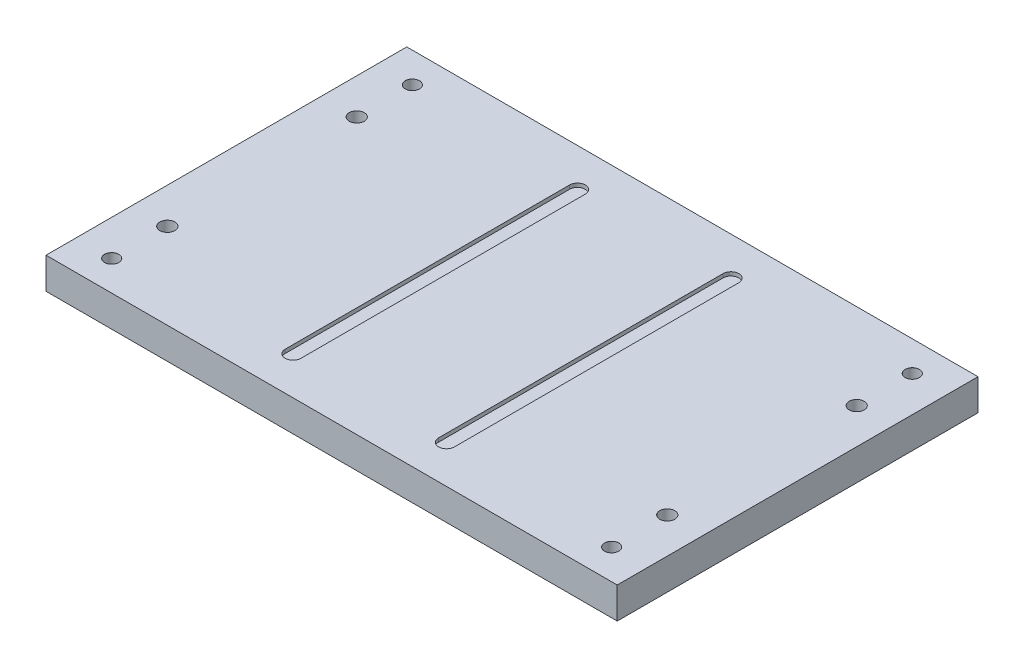
ISO-10303-21;
HEADER;
FILE_DESCRIPTION(('STEP AP214'),'2;1');
FILE_NAME('part.step','',(''),(''),'','','');
FILE_SCHEMA(('AUTOMOTIVE_DESIGN { 1 0 10303 214 1 1 1 1 }'));
ENDSEC;
DATA;
#1=APPLICATION_CONTEXT('core data for automotive mechanical design processes');
#2=APPLICATION_PROTOCOL_DEFINITION('international standard','automotive_design',2000,#1);
#3=PRODUCT_CONTEXT('',#1,'mechanical');
#4=PRODUCT('Part','Part','',(#3));
#5=PRODUCT_RELATED_PRODUCT_CATEGORY('part','',(#4));
#6=PRODUCT_DEFINITION_FORMATION('','',#4);
#7=PRODUCT_DEFINITION_CONTEXT('part definition',#1,'design');
#8=PRODUCT_DEFINITION('design','',#6,#7);
#9=PRODUCT_DEFINITION_SHAPE('','',#8);
#10=(LENGTH_UNIT() NAMED_UNIT(*) SI_UNIT(.MILLI.,.METRE.));
#11=(NAMED_UNIT(*) PLANE_ANGLE_UNIT() SI_UNIT($,.RADIAN.));
#12=(NAMED_UNIT(*) SI_UNIT($,.STERADIAN.) SOLID_ANGLE_UNIT());
#13=UNCERTAINTY_MEASURE_WITH_UNIT(LENGTH_MEASURE(1.E-05),#10,'distance_accuracy_value','');
#14=(GEOMETRIC_REPRESENTATION_CONTEXT(3) GLOBAL_UNCERTAINTY_ASSIGNED_CONTEXT((#13)) GLOBAL_UNIT_ASSIGNED_CONTEXT((#10,
#11,#12)) REPRESENTATION_CONTEXT('',''));
#15=CARTESIAN_POINT('',(0.,0.,0.));
#16=DIRECTION('',(0.,0.,1.));
#17=DIRECTION('',(1.,0.,0.));
#18=AXIS2_PLACEMENT_3D('',#15,#16,#17);
#19=CARTESIAN_POINT('',(0.,26.416,0.));
#20=DIRECTION('',(0.,-1.,0.));
#21=DIRECTION('',(0.,0.,-1.));
#22=AXIS2_PLACEMENT_3D('',#19,#20,#21);
#23=PLANE('',#22);
#24=CARTESIAN_POINT('',(-211.201,26.416,-127.));
#25=DIRECTION('',(0.,1.,0.));
#26=DIRECTION('',(0.,0.,1.));
#27=AXIS2_PLACEMENT_3D('',#24,#25,#26);
#28=CIRCLE('',#27,6.025);
#29=CARTESIAN_POINT('',(-211.201,26.416,-120.975));
#30=VERTEX_POINT('',#29);
#31=EDGE_CURVE('E647',#30,#30,#28,.T.);
#32=ORIENTED_EDGE('',*,*,#31,.F.);
#33=EDGE_LOOP('',(#32));
#34=FACE_BOUND('',#33,.T.);
#35=CARTESIAN_POINT('',(211.201,26.416,-127.));
#36=DIRECTION('',(0.,1.,0.));
#37=DIRECTION('',(0.,0.,1.));
#38=AXIS2_PLACEMENT_3D('',#35,#36,#37);
#39=CIRCLE('',#38,6.025);
#40=CARTESIAN_POINT('',(211.201,26.416,-120.975));
#41=VERTEX_POINT('',#40);
#42=EDGE_CURVE('E658',#41,#41,#39,.T.);
#43=ORIENTED_EDGE('',*,*,#42,.F.);
#44=EDGE_LOOP('',(#43));
#45=FACE_BOUND('',#44,.T.);
#46=CARTESIAN_POINT('',(211.201,26.416,127.));
#47=DIRECTION('',(0.,1.,0.));
#48=DIRECTION('',(0.,0.,1.));
#49=AXIS2_PLACEMENT_3D('',#46,#47,#48);
#50=CIRCLE('',#49,6.025);
#51=CARTESIAN_POINT('',(211.201,26.416,133.025));
#52=VERTEX_POINT('',#51);
#53=EDGE_CURVE('E670',#52,#52,#50,.T.);
#54=ORIENTED_EDGE('',*,*,#53,.F.);
#55=EDGE_LOOP('',(#54));
#56=FACE_BOUND('',#55,.T.);
#57=CARTESIAN_POINT('',(-211.201,26.416,127.));
#58=DIRECTION('',(0.,1.,0.));
#59=DIRECTION('',(0.,0.,1.));
#60=AXIS2_PLACEMENT_3D('',#57,#58,#59);
#61=CIRCLE('',#60,6.025);
#62=CARTESIAN_POINT('',(-211.201,26.416,133.025));
#63=VERTEX_POINT('',#62);
#64=EDGE_CURVE('E682',#63,#63,#61,.T.);
#65=ORIENTED_EDGE('',*,*,#64,.F.);
#66=EDGE_LOOP('',(#65));
#67=FACE_BOUND('',#66,.T.);
#68=CARTESIAN_POINT('',(-211.201,26.416,-80.01));
#69=DIRECTION('',(0.,1.,0.));
#70=DIRECTION('',(0.,0.,-1.));
#71=AXIS2_PLACEMENT_3D('',#68,#69,#70);
#72=CIRCLE('',#71,6.34999999999999);
#73=CARTESIAN_POINT('',(-211.201,26.416,-86.36));
#74=VERTEX_POINT('',#73);
#75=EDGE_CURVE('E711',#74,#74,#72,.T.);
#76=ORIENTED_EDGE('',*,*,#75,.F.);
#77=EDGE_LOOP('',(#76));
#78=FACE_BOUND('',#77,.T.);
#79=CARTESIAN_POINT('',(211.201,26.416,80.0099999999999));
#80=DIRECTION('',(0.,1.,0.));
#81=DIRECTION('',(0.,0.,-1.));
#82=AXIS2_PLACEMENT_3D('',#79,#80,#81);
#83=CIRCLE('',#82,6.34999999999999);
#84=CARTESIAN_POINT('',(211.201,26.416,73.66));
#85=VERTEX_POINT('',#84);
#86=EDGE_CURVE('E695',#85,#85,#83,.T.);
#87=ORIENTED_EDGE('',*,*,#86,.F.);
#88=EDGE_LOOP('',(#87));
#89=FACE_BOUND('',#88,.T.);
#90=CARTESIAN_POINT('',(211.201,26.416,-80.01));
#91=DIRECTION('',(0.,1.,0.));
#92=DIRECTION('',(0.,0.,1.));
#93=AXIS2_PLACEMENT_3D('',#90,#91,#92);
#94=CIRCLE('',#93,6.34999999999999);
#95=CARTESIAN_POINT('',(211.201,26.416,-73.6600000000001));
#96=VERTEX_POINT('',#95);
#97=EDGE_CURVE('E704',#96,#96,#94,.T.);
#98=ORIENTED_EDGE('',*,*,#97,.F.);
#99=EDGE_LOOP('',(#98));
#100=FACE_BOUND('',#99,.T.);
#101=CARTESIAN_POINT('',(-211.201,26.416,80.01));
#102=DIRECTION('',(0.,1.,0.));
#103=DIRECTION('',(0.,0.,1.));
#104=AXIS2_PLACEMENT_3D('',#101,#102,#103);
#105=CIRCLE('',#104,6.34999999999999);
#106=CARTESIAN_POINT('',(-211.201,26.416,86.36));
#107=VERTEX_POINT('',#106);
#108=EDGE_CURVE('E166',#107,#107,#105,.T.);
#109=ORIENTED_EDGE('',*,*,#108,.F.);
#110=EDGE_LOOP('',(#109));
#111=FACE_BOUND('',#110,.T.);
#112=DIRECTION('',(0.,0.,-1.));
#113=VECTOR('',#112,1.);
#114=CARTESIAN_POINT('',(-71.501,26.416,0.));
#115=LINE('',#114,#113);
#116=CARTESIAN_POINT('',(-71.501,26.416,120.142));
#117=VERTEX_POINT('',#116);
#118=CARTESIAN_POINT('',(-71.501,26.416,-120.142));
#119=VERTEX_POINT('',#118);
#120=EDGE_CURVE('E175',#117,#119,#115,.T.);
#121=ORIENTED_EDGE('',*,*,#120,.T.);
#122=CARTESIAN_POINT('',(-64.8335,26.416,-120.142));
#123=DIRECTION('',(0.,1.,0.));
#124=DIRECTION('',(0.,0.,1.));
#125=AXIS2_PLACEMENT_3D('',#122,#123,#124);
#126=CIRCLE('',#125,6.6675);
#127=CARTESIAN_POINT('',(-58.166,26.416,-120.142));
#128=VERTEX_POINT('',#127);
#129=EDGE_CURVE('E60',#128,#119,#126,.T.);
#130=ORIENTED_EDGE('',*,*,#129,.F.);
#131=DIRECTION('',(0.,0.,-1.));
#132=VECTOR('',#131,1.);
#133=CARTESIAN_POINT('',(-58.166,26.416,0.));
#134=LINE('',#133,#132);
#135=CARTESIAN_POINT('',(-58.166,26.416,120.142));
#136=VERTEX_POINT('',#135);
#137=EDGE_CURVE('E158',#136,#128,#134,.T.);
#138=ORIENTED_EDGE('',*,*,#137,.F.);
#139=CARTESIAN_POINT('',(-64.8335,26.416,120.142));
#140=DIRECTION('',(0.,1.,0.));
#141=DIRECTION('',(0.,0.,1.));
#142=AXIS2_PLACEMENT_3D('',#139,#140,#141);
#143=CIRCLE('',#142,6.6675);
#144=EDGE_CURVE('E163',#136,#117,#143,.F.);
#145=ORIENTED_EDGE('',*,*,#144,.T.);
#146=EDGE_LOOP('',(#121,#130,#138,#145));
#147=FACE_BOUND('',#146,.T.);
#148=DIRECTION('',(0.,0.,-1.));
#149=VECTOR('',#148,1.);
#150=CARTESIAN_POINT('',(241.3,26.416,152.4));
#151=LINE('',#150,#149);
#152=CARTESIAN_POINT('',(241.3,26.416,152.4));
#153=VERTEX_POINT('',#152);
#154=CARTESIAN_POINT('',(241.3,26.416,-152.4));
#155=VERTEX_POINT('',#154);
#156=EDGE_CURVE('E231',#153,#155,#151,.T.);
#157=ORIENTED_EDGE('',*,*,#156,.T.);
#158=DIRECTION('',(-1.,0.,0.));
#159=VECTOR('',#158,1.);
#160=CARTESIAN_POINT('',(-241.3,26.416,-152.4));
#161=LINE('',#160,#159);
#162=CARTESIAN_POINT('',(-241.3,26.416,-152.4));
#163=VERTEX_POINT('',#162);
#164=EDGE_CURVE('E235',#155,#163,#161,.T.);
#165=ORIENTED_EDGE('',*,*,#164,.T.);
#166=DIRECTION('',(0.,0.,1.));
#167=VECTOR('',#166,1.);
#168=CARTESIAN_POINT('',(-241.3,26.416,152.4));
#169=LINE('',#168,#167);
#170=CARTESIAN_POINT('',(-241.3,26.416,152.4));
#171=VERTEX_POINT('',#170);
#172=EDGE_CURVE('E239',#163,#171,#169,.T.);
#173=ORIENTED_EDGE('',*,*,#172,.T.);
#174=DIRECTION('',(1.,0.,0.));
#175=VECTOR('',#174,1.);
#176=CARTESIAN_POINT('',(-241.3,26.416,152.4));
#177=LINE('',#176,#175);
#178=EDGE_CURVE('E242',#171,#153,#177,.T.);
#179=ORIENTED_EDGE('',*,*,#178,.T.);
#180=EDGE_LOOP('',(#157,#165,#173,#179));
#181=FACE_BOUND('',#180,.T.);
#182=CARTESIAN_POINT('',(64.8335,26.416,-120.142));
#183=DIRECTION('',(0.,1.,0.));
#184=DIRECTION('',(0.,0.,1.));
#185=AXIS2_PLACEMENT_3D('',#182,#183,#184);
#186=CIRCLE('',#185,6.66749999999999);
#187=CARTESIAN_POINT('',(58.1660000000001,26.416,-120.142));
#188=VERTEX_POINT('',#187);
#189=CARTESIAN_POINT('',(71.501,26.416,-120.142));
#190=VERTEX_POINT('',#189);
#191=EDGE_CURVE('E68',#188,#190,#186,.F.);
#192=ORIENTED_EDGE('',*,*,#191,.T.);
#193=DIRECTION('',(0.,0.,-1.));
#194=VECTOR('',#193,1.);
#195=CARTESIAN_POINT('',(71.501,26.416,0.));
#196=LINE('',#195,#194);
#197=CARTESIAN_POINT('',(71.501,26.416,120.142));
#198=VERTEX_POINT('',#197);
#199=EDGE_CURVE('E204',#198,#190,#196,.T.);
#200=ORIENTED_EDGE('',*,*,#199,.F.);
#201=CARTESIAN_POINT('',(64.8335000000001,26.416,120.142));
#202=DIRECTION('',(0.,1.,0.));
#203=DIRECTION('',(0.,0.,1.));
#204=AXIS2_PLACEMENT_3D('',#201,#202,#203);
#205=CIRCLE('',#204,6.66749999999999);
#206=CARTESIAN_POINT('',(58.1660000000001,26.416,120.142));
#207=VERTEX_POINT('',#206);
#208=EDGE_CURVE('E208',#207,#198,#205,.T.);
#209=ORIENTED_EDGE('',*,*,#208,.F.);
#210=DIRECTION('',(0.,0.,-1.));
#211=VECTOR('',#210,1.);
#212=CARTESIAN_POINT('',(58.1660000000001,26.416,0.));
#213=LINE('',#212,#211);
#214=EDGE_CURVE('E213',#207,#188,#213,.T.);
#215=ORIENTED_EDGE('',*,*,#214,.T.);
#216=EDGE_LOOP('',(#192,#200,#209,#215));
#217=FACE_BOUND('',#216,.T.);
#218=ADVANCED_FACE('F44',(#34,#45,#56,#67,#78,#89,#100,#111,#147,#181,#217),#23,.F.);
#219=CARTESIAN_POINT('',(241.3,26.416,152.4));
#220=DIRECTION('',(-1.,0.,0.));
#221=DIRECTION('',(0.,0.,1.));
#222=AXIS2_PLACEMENT_3D('',#219,#220,#221);
#223=PLANE('',#222);
#224=DIRECTION('',(0.,0.,-1.));
#225=VECTOR('',#224,1.);
#226=CARTESIAN_POINT('',(241.3,0.,152.4));
#227=LINE('',#226,#225);
#228=CARTESIAN_POINT('',(241.3,0.,152.4));
#229=VERTEX_POINT('',#228);
#230=CARTESIAN_POINT('',(241.3,0.,-152.4));
#231=VERTEX_POINT('',#230);
#232=EDGE_CURVE('E184',#229,#231,#227,.T.);
#233=ORIENTED_EDGE('',*,*,#232,.T.);
#234=DIRECTION('',(0.,-1.,0.));
#235=VECTOR('',#234,1.);
#236=CARTESIAN_POINT('',(241.3,26.416,-152.4));
#237=LINE('',#236,#235);
#238=EDGE_CURVE('E11',#155,#231,#237,.T.);
#239=ORIENTED_EDGE('',*,*,#238,.F.);
#240=ORIENTED_EDGE('',*,*,#156,.F.);
#241=DIRECTION('',(0.,-1.,0.));
#242=VECTOR('',#241,1.);
#243=CARTESIAN_POINT('',(241.3,26.416,152.4));
#244=LINE('',#243,#242);
#245=EDGE_CURVE('E245',#153,#229,#244,.T.);
#246=ORIENTED_EDGE('',*,*,#245,.T.);
#247=EDGE_LOOP('',(#233,#239,#240,#246));
#248=FACE_BOUND('',#247,.T.);
#249=ADVANCED_FACE('F46',(#248),#223,.F.);
#250=CARTESIAN_POINT('',(-241.3,26.416,-152.4));
#251=DIRECTION('',(0.,0.,1.));
#252=DIRECTION('',(1.,0.,0.));
#253=AXIS2_PLACEMENT_3D('',#250,#251,#252);
#254=PLANE('',#253);
#255=DIRECTION('',(-1.,0.,0.));
#256=VECTOR('',#255,1.);
#257=CARTESIAN_POINT('',(-241.3,0.,-152.4));
#258=LINE('',#257,#256);
#259=CARTESIAN_POINT('',(-241.3,0.,-152.4));
#260=VERTEX_POINT('',#259);
#261=EDGE_CURVE('E249',#231,#260,#258,.T.);
#262=ORIENTED_EDGE('',*,*,#261,.T.);
#263=DIRECTION('',(0.,-1.,0.));
#264=VECTOR('',#263,1.);
#265=CARTESIAN_POINT('',(-241.3,26.416,-152.4));
#266=LINE('',#265,#264);
#267=EDGE_CURVE('E53',#163,#260,#266,.T.);
#268=ORIENTED_EDGE('',*,*,#267,.F.);
#269=ORIENTED_EDGE('',*,*,#164,.F.);
#270=ORIENTED_EDGE('',*,*,#238,.T.);
#271=EDGE_LOOP('',(#262,#268,#269,#270));
#272=FACE_BOUND('',#271,.T.);
#273=ADVANCED_FACE('F286',(#272),#254,.F.);
#274=CARTESIAN_POINT('',(-241.3,26.416,152.4));
#275=DIRECTION('',(1.,0.,0.));
#276=DIRECTION('',(0.,0.,-1.));
#277=AXIS2_PLACEMENT_3D('',#274,#275,#276);
#278=PLANE('',#277);
#279=DIRECTION('',(0.,0.,1.));
#280=VECTOR('',#279,1.);
#281=CARTESIAN_POINT('',(-241.3,0.,152.4));
#282=LINE('',#281,#280);
#283=CARTESIAN_POINT('',(-241.3,0.,152.4));
#284=VERTEX_POINT('',#283);
#285=EDGE_CURVE('E252',#260,#284,#282,.T.);
#286=ORIENTED_EDGE('',*,*,#285,.T.);
#287=DIRECTION('',(0.,-1.,0.));
#288=VECTOR('',#287,1.);
#289=CARTESIAN_POINT('',(-241.3,26.416,152.4));
#290=LINE('',#289,#288);
#291=EDGE_CURVE('E260',#171,#284,#290,.T.);
#292=ORIENTED_EDGE('',*,*,#291,.F.);
#293=ORIENTED_EDGE('',*,*,#172,.F.);
#294=ORIENTED_EDGE('',*,*,#267,.T.);
#295=EDGE_LOOP('',(#286,#292,#293,#294));
#296=FACE_BOUND('',#295,.T.);
#297=ADVANCED_FACE('F270',(#296),#278,.F.);
#298=CARTESIAN_POINT('',(-241.3,26.416,152.4));
#299=DIRECTION('',(0.,0.,-1.));
#300=DIRECTION('',(-1.,0.,0.));
#301=AXIS2_PLACEMENT_3D('',#298,#299,#300);
#302=PLANE('',#301);
#303=DIRECTION('',(1.,0.,0.));
#304=VECTOR('',#303,1.);
#305=CARTESIAN_POINT('',(-241.3,0.,152.4));
#306=LINE('',#305,#304);
#307=EDGE_CURVE('E236',#284,#229,#306,.T.);
#308=ORIENTED_EDGE('',*,*,#307,.T.);
#309=ORIENTED_EDGE('',*,*,#245,.F.);
#310=ORIENTED_EDGE('',*,*,#178,.F.);
#311=ORIENTED_EDGE('',*,*,#291,.T.);
#312=EDGE_LOOP('',(#308,#309,#310,#311));
#313=FACE_BOUND('',#312,.T.);
#314=ADVANCED_FACE('F279',(#313),#302,.F.);
#315=CARTESIAN_POINT('',(0.,0.,0.));
#316=DIRECTION('',(0.,-1.,0.));
#317=DIRECTION('',(0.,0.,-1.));
#318=AXIS2_PLACEMENT_3D('',#315,#316,#317);
#319=PLANE('',#318);
#320=CARTESIAN_POINT('',(-211.201,0.,-127.));
#321=DIRECTION('',(0.,1.,0.));
#322=DIRECTION('',(0.,0.,1.));
#323=AXIS2_PLACEMENT_3D('',#320,#321,#322);
#324=CIRCLE('',#323,6.00000000000001);
#325=CARTESIAN_POINT('',(-211.201,0.,-121.));
#326=VERTEX_POINT('',#325);
#327=EDGE_CURVE('E652',#326,#326,#324,.T.);
#328=ORIENTED_EDGE('',*,*,#327,.T.);
#329=EDGE_LOOP('',(#328));
#330=FACE_BOUND('',#329,.T.);
#331=CARTESIAN_POINT('',(211.201,0.,-127.));
#332=DIRECTION('',(0.,1.,0.));
#333=DIRECTION('',(0.,0.,1.));
#334=AXIS2_PLACEMENT_3D('',#331,#332,#333);
#335=CIRCLE('',#334,6.00000000000001);
#336=CARTESIAN_POINT('',(211.201,0.,-121.));
#337=VERTEX_POINT('',#336);
#338=EDGE_CURVE('E666',#337,#337,#335,.T.);
#339=ORIENTED_EDGE('',*,*,#338,.T.);
#340=EDGE_LOOP('',(#339));
#341=FACE_BOUND('',#340,.T.);
#342=CARTESIAN_POINT('',(211.201,0.,127.));
#343=DIRECTION('',(0.,1.,0.));
#344=DIRECTION('',(0.,0.,1.));
#345=AXIS2_PLACEMENT_3D('',#342,#343,#344);
#346=CIRCLE('',#345,6.00000000000001);
#347=CARTESIAN_POINT('',(211.201,0.,133.));
#348=VERTEX_POINT('',#347);
#349=EDGE_CURVE('E678',#348,#348,#346,.T.);
#350=ORIENTED_EDGE('',*,*,#349,.T.);
#351=EDGE_LOOP('',(#350));
#352=FACE_BOUND('',#351,.T.);
#353=CARTESIAN_POINT('',(-211.201,0.,127.));
#354=DIRECTION('',(0.,1.,0.));
#355=DIRECTION('',(0.,0.,1.));
#356=AXIS2_PLACEMENT_3D('',#353,#354,#355);
#357=CIRCLE('',#356,6.00000000000001);
#358=CARTESIAN_POINT('',(-211.201,0.,133.));
#359=VERTEX_POINT('',#358);
#360=EDGE_CURVE('E690',#359,#359,#357,.T.);
#361=ORIENTED_EDGE('',*,*,#360,.T.);
#362=EDGE_LOOP('',(#361));
#363=FACE_BOUND('',#362,.T.);
#364=CARTESIAN_POINT('',(-211.201,0.,-80.01));
#365=DIRECTION('',(0.,1.,0.));
#366=DIRECTION('',(0.,0.,-1.));
#367=AXIS2_PLACEMENT_3D('',#364,#365,#366);
#368=CIRCLE('',#367,6.34999999999999);
#369=CARTESIAN_POINT('',(-211.201,0.,-86.36));
#370=VERTEX_POINT('',#369);
#371=EDGE_CURVE('E699',#370,#370,#368,.T.);
#372=ORIENTED_EDGE('',*,*,#371,.T.);
#373=EDGE_LOOP('',(#372));
#374=FACE_BOUND('',#373,.T.);
#375=CARTESIAN_POINT('',(211.201,0.,80.0099999999999));
#376=DIRECTION('',(0.,1.,0.));
#377=DIRECTION('',(0.,0.,-1.));
#378=AXIS2_PLACEMENT_3D('',#375,#376,#377);
#379=CIRCLE('',#378,6.34999999999999);
#380=CARTESIAN_POINT('',(211.201,0.,73.66));
#381=VERTEX_POINT('',#380);
#382=EDGE_CURVE('E700',#381,#381,#379,.T.);
#383=ORIENTED_EDGE('',*,*,#382,.T.);
#384=EDGE_LOOP('',(#383));
#385=FACE_BOUND('',#384,.T.);
#386=CARTESIAN_POINT('',(211.201,0.,-80.01));
#387=DIRECTION('',(0.,1.,0.));
#388=DIRECTION('',(0.,0.,1.));
#389=AXIS2_PLACEMENT_3D('',#386,#387,#388);
#390=CIRCLE('',#389,6.34999999999999);
#391=CARTESIAN_POINT('',(211.201,0.,-73.6600000000001));
#392=VERTEX_POINT('',#391);
#393=EDGE_CURVE('E694',#392,#392,#390,.T.);
#394=ORIENTED_EDGE('',*,*,#393,.T.);
#395=EDGE_LOOP('',(#394));
#396=FACE_BOUND('',#395,.T.);
#397=CARTESIAN_POINT('',(-211.201,0.,80.01));
#398=DIRECTION('',(0.,1.,0.));
#399=DIRECTION('',(0.,0.,1.));
#400=AXIS2_PLACEMENT_3D('',#397,#398,#399);
#401=CIRCLE('',#400,6.34999999999999);
#402=CARTESIAN_POINT('',(-211.201,0.,86.36));
#403=VERTEX_POINT('',#402);
#404=EDGE_CURVE('E203',#403,#403,#401,.T.);
#405=ORIENTED_EDGE('',*,*,#404,.T.);
#406=EDGE_LOOP('',(#405));
#407=FACE_BOUND('',#406,.T.);
#408=ORIENTED_EDGE('',*,*,#232,.F.);
#409=ORIENTED_EDGE('',*,*,#307,.F.);
#410=ORIENTED_EDGE('',*,*,#285,.F.);
#411=ORIENTED_EDGE('',*,*,#261,.F.);
#412=EDGE_LOOP('',(#408,#409,#410,#411));
#413=FACE_BOUND('',#412,.T.);
#414=ADVANCED_FACE('F276',(#330,#341,#352,#363,#374,#385,#396,#407,#413),#319,.T.);
#415=CARTESIAN_POINT('',(64.8335,23.241,-120.142));
#416=DIRECTION('',(0.,1.,0.));
#417=DIRECTION('',(0.,0.,1.));
#418=AXIS2_PLACEMENT_3D('',#415,#416,#417);
#419=CYLINDRICAL_SURFACE('',#418,6.66749999999999);
#420=ORIENTED_EDGE('',*,*,#191,.F.);
#421=DIRECTION('',(0.,1.,0.));
#422=VECTOR('',#421,1.);
#423=CARTESIAN_POINT('',(58.1660000000001,23.241,-120.142));
#424=LINE('',#423,#422);
#425=CARTESIAN_POINT('',(58.1660000000001,23.241,-120.142));
#426=VERTEX_POINT('',#425);
#427=EDGE_CURVE('E190',#426,#188,#424,.T.);
#428=ORIENTED_EDGE('',*,*,#427,.F.);
#429=CARTESIAN_POINT('',(64.8335,23.241,-120.142));
#430=DIRECTION('',(0.,1.,0.));
#431=DIRECTION('',(0.,0.,1.));
#432=AXIS2_PLACEMENT_3D('',#429,#430,#431);
#433=CIRCLE('',#432,6.66749999999999);
#434=CARTESIAN_POINT('',(71.501,23.241,-120.142));
#435=VERTEX_POINT('',#434);
#436=EDGE_CURVE('E209',#426,#435,#433,.F.);
#437=ORIENTED_EDGE('',*,*,#436,.T.);
#438=DIRECTION('',(0.,1.,0.));
#439=VECTOR('',#438,1.);
#440=CARTESIAN_POINT('',(71.501,23.241,-120.142));
#441=LINE('',#440,#439);
#442=EDGE_CURVE('E200',#435,#190,#441,.T.);
#443=ORIENTED_EDGE('',*,*,#442,.T.);
#444=EDGE_LOOP('',(#420,#428,#437,#443));
#445=FACE_BOUND('',#444,.T.);
#446=ADVANCED_FACE('F306',(#445),#419,.F.);
#447=CARTESIAN_POINT('',(71.501,23.241,0.));
#448=DIRECTION('',(1.,0.,0.));
#449=DIRECTION('',(0.,0.,-1.));
#450=AXIS2_PLACEMENT_3D('',#447,#448,#449);
#451=PLANE('',#450);
#452=ORIENTED_EDGE('',*,*,#199,.T.);
#453=ORIENTED_EDGE('',*,*,#442,.F.);
#454=DIRECTION('',(0.,0.,-1.));
#455=VECTOR('',#454,1.);
#456=CARTESIAN_POINT('',(71.501,23.241,0.));
#457=LINE('',#456,#455);
#458=CARTESIAN_POINT('',(71.501,23.241,120.142));
#459=VERTEX_POINT('',#458);
#460=EDGE_CURVE('E193',#459,#435,#457,.T.);
#461=ORIENTED_EDGE('',*,*,#460,.F.);
#462=DIRECTION('',(0.,1.,0.));
#463=VECTOR('',#462,1.);
#464=CARTESIAN_POINT('',(71.501,23.241,120.142));
#465=LINE('',#464,#463);
#466=EDGE_CURVE('E197',#459,#198,#465,.T.);
#467=ORIENTED_EDGE('',*,*,#466,.T.);
#468=EDGE_LOOP('',(#452,#453,#461,#467));
#469=FACE_BOUND('',#468,.T.);
#470=ADVANCED_FACE('F324',(#469),#451,.F.);
#471=CARTESIAN_POINT('',(64.8335000000001,23.241,120.142));
#472=DIRECTION('',(0.,1.,0.));
#473=DIRECTION('',(0.,0.,1.));
#474=AXIS2_PLACEMENT_3D('',#471,#472,#473);
#475=CYLINDRICAL_SURFACE('',#474,6.66749999999999);
#476=ORIENTED_EDGE('',*,*,#208,.T.);
#477=ORIENTED_EDGE('',*,*,#466,.F.);
#478=CARTESIAN_POINT('',(64.8335000000001,23.241,120.142));
#479=DIRECTION('',(0.,1.,0.));
#480=DIRECTION('',(0.,0.,1.));
#481=AXIS2_PLACEMENT_3D('',#478,#479,#480);
#482=CIRCLE('',#481,6.66749999999999);
#483=CARTESIAN_POINT('',(58.1660000000001,23.241,120.142));
#484=VERTEX_POINT('',#483);
#485=EDGE_CURVE('E222',#484,#459,#482,.T.);
#486=ORIENTED_EDGE('',*,*,#485,.F.);
#487=DIRECTION('',(0.,1.,0.));
#488=VECTOR('',#487,1.);
#489=CARTESIAN_POINT('',(58.1660000000001,23.241,120.142));
#490=LINE('',#489,#488);
#491=EDGE_CURVE('E194',#484,#207,#490,.T.);
#492=ORIENTED_EDGE('',*,*,#491,.T.);
#493=EDGE_LOOP('',(#476,#477,#486,#492));
#494=FACE_BOUND('',#493,.T.);
#495=ADVANCED_FACE('F331',(#494),#475,.F.);
#496=CARTESIAN_POINT('',(58.1660000000001,23.241,0.));
#497=DIRECTION('',(1.,0.,0.));
#498=DIRECTION('',(0.,0.,-1.));
#499=AXIS2_PLACEMENT_3D('',#496,#497,#498);
#500=PLANE('',#499);
#501=ORIENTED_EDGE('',*,*,#214,.F.);
#502=ORIENTED_EDGE('',*,*,#491,.F.);
#503=DIRECTION('',(0.,0.,-1.));
#504=VECTOR('',#503,1.);
#505=CARTESIAN_POINT('',(58.1660000000001,23.241,0.));
#506=LINE('',#505,#504);
#507=EDGE_CURVE('E226',#484,#426,#506,.T.);
#508=ORIENTED_EDGE('',*,*,#507,.T.);
#509=ORIENTED_EDGE('',*,*,#427,.T.);
#510=EDGE_LOOP('',(#501,#502,#508,#509));
#511=FACE_BOUND('',#510,.T.);
#512=ADVANCED_FACE('F338',(#511),#500,.T.);
#513=CARTESIAN_POINT('',(0.,23.241,0.));
#514=DIRECTION('',(0.,1.,0.));
#515=DIRECTION('',(0.,0.,1.));
#516=AXIS2_PLACEMENT_3D('',#513,#514,#515);
#517=PLANE('',#516);
#518=ORIENTED_EDGE('',*,*,#436,.F.);
#519=ORIENTED_EDGE('',*,*,#507,.F.);
#520=ORIENTED_EDGE('',*,*,#485,.T.);
#521=ORIENTED_EDGE('',*,*,#460,.T.);
#522=EDGE_LOOP('',(#518,#519,#520,#521));
#523=FACE_BOUND('',#522,.T.);
#524=ADVANCED_FACE('F302',(#523),#517,.T.);
#525=CARTESIAN_POINT('',(-64.8335,23.241,-120.142));
#526=DIRECTION('',(0.,1.,0.));
#527=DIRECTION('',(0.,0.,1.));
#528=AXIS2_PLACEMENT_3D('',#525,#526,#527);
#529=CYLINDRICAL_SURFACE('',#528,6.6675);
#530=ORIENTED_EDGE('',*,*,#129,.T.);
#531=DIRECTION('',(0.,1.,0.));
#532=VECTOR('',#531,1.);
#533=CARTESIAN_POINT('',(-71.501,23.241,-120.142));
#534=LINE('',#533,#532);
#535=CARTESIAN_POINT('',(-71.501,23.241,-120.142));
#536=VERTEX_POINT('',#535);
#537=EDGE_CURVE('E139',#536,#119,#534,.T.);
#538=ORIENTED_EDGE('',*,*,#537,.F.);
#539=CARTESIAN_POINT('',(-64.8335,23.241,-120.142));
#540=DIRECTION('',(0.,1.,0.));
#541=DIRECTION('',(0.,0.,1.));
#542=AXIS2_PLACEMENT_3D('',#539,#540,#541);
#543=CIRCLE('',#542,6.6675);
#544=CARTESIAN_POINT('',(-58.166,23.241,-120.142));
#545=VERTEX_POINT('',#544);
#546=EDGE_CURVE('E147',#545,#536,#543,.T.);
#547=ORIENTED_EDGE('',*,*,#546,.F.);
#548=DIRECTION('',(0.,1.,0.));
#549=VECTOR('',#548,1.);
#550=CARTESIAN_POINT('',(-58.166,23.241,-120.142));
#551=LINE('',#550,#549);
#552=EDGE_CURVE('E181',#545,#128,#551,.T.);
#553=ORIENTED_EDGE('',*,*,#552,.T.);
#554=EDGE_LOOP('',(#530,#538,#547,#553));
#555=FACE_BOUND('',#554,.T.);
#556=ADVANCED_FACE('F150',(#555),#529,.F.);
#557=CARTESIAN_POINT('',(-58.166,23.241,0.));
#558=DIRECTION('',(1.,0.,0.));
#559=DIRECTION('',(0.,0.,-1.));
#560=AXIS2_PLACEMENT_3D('',#557,#558,#559);
#561=PLANE('',#560);
#562=ORIENTED_EDGE('',*,*,#137,.T.);
#563=ORIENTED_EDGE('',*,*,#552,.F.);
#564=DIRECTION('',(0.,0.,-1.));
#565=VECTOR('',#564,1.);
#566=CARTESIAN_POINT('',(-58.166,23.241,0.));
#567=LINE('',#566,#565);
#568=CARTESIAN_POINT('',(-58.166,23.241,120.142));
#569=VERTEX_POINT('',#568);
#570=EDGE_CURVE('E153',#569,#545,#567,.T.);
#571=ORIENTED_EDGE('',*,*,#570,.F.);
#572=DIRECTION('',(0.,1.,0.));
#573=VECTOR('',#572,1.);
#574=CARTESIAN_POINT('',(-58.166,23.241,120.142));
#575=LINE('',#574,#573);
#576=EDGE_CURVE('E185',#569,#136,#575,.T.);
#577=ORIENTED_EDGE('',*,*,#576,.T.);
#578=EDGE_LOOP('',(#562,#563,#571,#577));
#579=FACE_BOUND('',#578,.T.);
#580=ADVANCED_FACE('F359',(#579),#561,.F.);
#581=CARTESIAN_POINT('',(-64.8335,23.241,120.142));
#582=DIRECTION('',(0.,1.,0.));
#583=DIRECTION('',(0.,0.,1.));
#584=AXIS2_PLACEMENT_3D('',#581,#582,#583);
#585=CYLINDRICAL_SURFACE('',#584,6.6675);
#586=ORIENTED_EDGE('',*,*,#144,.F.);
#587=ORIENTED_EDGE('',*,*,#576,.F.);
#588=CARTESIAN_POINT('',(-64.8335,23.241,120.142));
#589=DIRECTION('',(0.,1.,0.));
#590=DIRECTION('',(0.,0.,1.));
#591=AXIS2_PLACEMENT_3D('',#588,#589,#590);
#592=CIRCLE('',#591,6.6675);
#593=CARTESIAN_POINT('',(-71.501,23.241,120.142));
#594=VERTEX_POINT('',#593);
#595=EDGE_CURVE('E146',#569,#594,#592,.F.);
#596=ORIENTED_EDGE('',*,*,#595,.T.);
#597=DIRECTION('',(0.,1.,0.));
#598=VECTOR('',#597,1.);
#599=CARTESIAN_POINT('',(-71.501,23.241,120.142));
#600=LINE('',#599,#598);
#601=EDGE_CURVE('E141',#594,#117,#600,.T.);
#602=ORIENTED_EDGE('',*,*,#601,.T.);
#603=EDGE_LOOP('',(#586,#587,#596,#602));
#604=FACE_BOUND('',#603,.T.);
#605=ADVANCED_FACE('F366',(#604),#585,.F.);
#606=CARTESIAN_POINT('',(-71.501,23.241,0.));
#607=DIRECTION('',(1.,0.,0.));
#608=DIRECTION('',(0.,0.,-1.));
#609=AXIS2_PLACEMENT_3D('',#606,#607,#608);
#610=PLANE('',#609);
#611=ORIENTED_EDGE('',*,*,#120,.F.);
#612=ORIENTED_EDGE('',*,*,#601,.F.);
#613=DIRECTION('',(0.,0.,-1.));
#614=VECTOR('',#613,1.);
#615=CARTESIAN_POINT('',(-71.501,23.241,0.));
#616=LINE('',#615,#614);
#617=EDGE_CURVE('E136',#594,#536,#616,.T.);
#618=ORIENTED_EDGE('',*,*,#617,.T.);
#619=ORIENTED_EDGE('',*,*,#537,.T.);
#620=EDGE_LOOP('',(#611,#612,#618,#619));
#621=FACE_BOUND('',#620,.T.);
#622=ADVANCED_FACE('F138',(#621),#610,.T.);
#623=CARTESIAN_POINT('',(0.,23.241,0.));
#624=DIRECTION('',(0.,1.,0.));
#625=DIRECTION('',(0.,0.,1.));
#626=AXIS2_PLACEMENT_3D('',#623,#624,#625);
#627=PLANE('',#626);
#628=ORIENTED_EDGE('',*,*,#546,.T.);
#629=ORIENTED_EDGE('',*,*,#617,.F.);
#630=ORIENTED_EDGE('',*,*,#595,.F.);
#631=ORIENTED_EDGE('',*,*,#570,.T.);
#632=EDGE_LOOP('',(#628,#629,#630,#631));
#633=FACE_BOUND('',#632,.T.);
#634=ADVANCED_FACE('F155',(#633),#627,.T.);
#635=CARTESIAN_POINT('',(-211.201,0.,80.01));
#636=DIRECTION('',(0.,1.,0.));
#637=DIRECTION('',(0.,0.,1.));
#638=AXIS2_PLACEMENT_3D('',#635,#636,#637);
#639=CYLINDRICAL_SURFACE('',#638,6.34999999999999);
#640=ORIENTED_EDGE('',*,*,#404,.F.);
#641=EDGE_LOOP('',(#640));
#642=FACE_BOUND('',#641,.T.);
#643=ORIENTED_EDGE('',*,*,#108,.T.);
#644=EDGE_LOOP('',(#643));
#645=FACE_BOUND('',#644,.T.);
#646=ADVANCED_FACE('F387',(#642,#645),#639,.F.);
#647=CARTESIAN_POINT('',(211.201,0.,-80.01));
#648=DIRECTION('',(0.,1.,0.));
#649=DIRECTION('',(0.,0.,1.));
#650=AXIS2_PLACEMENT_3D('',#647,#648,#649);
#651=CYLINDRICAL_SURFACE('',#650,6.34999999999999);
#652=ORIENTED_EDGE('',*,*,#393,.F.);
#653=EDGE_LOOP('',(#652));
#654=FACE_BOUND('',#653,.T.);
#655=ORIENTED_EDGE('',*,*,#97,.T.);
#656=EDGE_LOOP('',(#655));
#657=FACE_BOUND('',#656,.T.);
#658=ADVANCED_FACE('F394',(#654,#657),#651,.F.);
#659=CARTESIAN_POINT('',(211.201,0.,80.0099999999999));
#660=DIRECTION('',(0.,1.,0.));
#661=DIRECTION('',(0.,0.,1.));
#662=AXIS2_PLACEMENT_3D('',#659,#660,#661);
#663=CYLINDRICAL_SURFACE('',#662,6.34999999999999);
#664=ORIENTED_EDGE('',*,*,#382,.F.);
#665=EDGE_LOOP('',(#664));
#666=FACE_BOUND('',#665,.T.);
#667=ORIENTED_EDGE('',*,*,#86,.T.);
#668=EDGE_LOOP('',(#667));
#669=FACE_BOUND('',#668,.T.);
#670=ADVANCED_FACE('F402',(#666,#669),#663,.F.);
#671=CARTESIAN_POINT('',(-211.201,0.,-80.01));
#672=DIRECTION('',(0.,1.,0.));
#673=DIRECTION('',(0.,0.,1.));
#674=AXIS2_PLACEMENT_3D('',#671,#672,#673);
#675=CYLINDRICAL_SURFACE('',#674,6.34999999999999);
#676=ORIENTED_EDGE('',*,*,#371,.F.);
#677=EDGE_LOOP('',(#676));
#678=FACE_BOUND('',#677,.T.);
#679=ORIENTED_EDGE('',*,*,#75,.T.);
#680=EDGE_LOOP('',(#679));
#681=FACE_BOUND('',#680,.T.);
#682=ADVANCED_FACE('F410',(#678,#681),#675,.F.);
#683=CARTESIAN_POINT('',(-211.201,26.416,127.));
#684=DIRECTION('',(0.,1.,0.));
#685=DIRECTION('',(0.,0.,1.));
#686=AXIS2_PLACEMENT_3D('',#683,#684,#685);
#687=CYLINDRICAL_SURFACE('',#686,5.99999999999999);
#688=ORIENTED_EDGE('',*,*,#360,.F.);
#689=EDGE_LOOP('',(#688));
#690=FACE_BOUND('',#689,.T.);
#691=CARTESIAN_POINT('',(-211.201,26.391,127.));
#692=DIRECTION('',(0.,1.,0.));
#693=DIRECTION('',(0.,0.,1.));
#694=AXIS2_PLACEMENT_3D('',#691,#692,#693);
#695=CIRCLE('',#694,5.99999999999998);
#696=CARTESIAN_POINT('',(-211.201,26.391,133.));
#697=VERTEX_POINT('',#696);
#698=EDGE_CURVE('E686',#697,#697,#695,.T.);
#699=ORIENTED_EDGE('',*,*,#698,.T.);
#700=EDGE_LOOP('',(#699));
#701=FACE_BOUND('',#700,.T.);
#702=ADVANCED_FACE('F418',(#690,#701),#687,.F.);
#703=CARTESIAN_POINT('',(-211.201,26.416,127.));
#704=DIRECTION('',(0.,1.,0.));
#705=DIRECTION('',(0.,0.,1.));
#706=AXIS2_PLACEMENT_3D('',#703,#704,#705);
#707=CONICAL_SURFACE('',#706,6.025,0.785398163398003);
#708=ORIENTED_EDGE('',*,*,#698,.F.);
#709=EDGE_LOOP('',(#708));
#710=FACE_BOUND('',#709,.T.);
#711=ORIENTED_EDGE('',*,*,#64,.T.);
#712=EDGE_LOOP('',(#711));
#713=FACE_BOUND('',#712,.T.);
#714=ADVANCED_FACE('F426',(#710,#713),#707,.F.);
#715=CARTESIAN_POINT('',(211.201,26.416,127.));
#716=DIRECTION('',(0.,1.,0.));
#717=DIRECTION('',(0.,0.,1.));
#718=AXIS2_PLACEMENT_3D('',#715,#716,#717);
#719=CYLINDRICAL_SURFACE('',#718,5.99999999999999);
#720=ORIENTED_EDGE('',*,*,#349,.F.);
#721=EDGE_LOOP('',(#720));
#722=FACE_BOUND('',#721,.T.);
#723=CARTESIAN_POINT('',(211.201,26.391,127.));
#724=DIRECTION('',(0.,1.,0.));
#725=DIRECTION('',(0.,0.,1.));
#726=AXIS2_PLACEMENT_3D('',#723,#724,#725);
#727=CIRCLE('',#726,5.99999999999998);
#728=CARTESIAN_POINT('',(211.201,26.391,133.));
#729=VERTEX_POINT('',#728);
#730=EDGE_CURVE('E674',#729,#729,#727,.T.);
#731=ORIENTED_EDGE('',*,*,#730,.T.);
#732=EDGE_LOOP('',(#731));
#733=FACE_BOUND('',#732,.T.);
#734=ADVANCED_FACE('F434',(#722,#733),#719,.F.);
#735=CARTESIAN_POINT('',(211.201,26.416,127.));
#736=DIRECTION('',(0.,1.,0.));
#737=DIRECTION('',(0.,0.,1.));
#738=AXIS2_PLACEMENT_3D('',#735,#736,#737);
#739=CONICAL_SURFACE('',#738,6.025,0.785398163398003);
#740=ORIENTED_EDGE('',*,*,#730,.F.);
#741=EDGE_LOOP('',(#740));
#742=FACE_BOUND('',#741,.T.);
#743=ORIENTED_EDGE('',*,*,#53,.T.);
#744=EDGE_LOOP('',(#743));
#745=FACE_BOUND('',#744,.T.);
#746=ADVANCED_FACE('F441',(#742,#745),#739,.F.);
#747=CARTESIAN_POINT('',(211.201,26.416,-127.));
#748=DIRECTION('',(0.,1.,0.));
#749=DIRECTION('',(0.,0.,1.));
#750=AXIS2_PLACEMENT_3D('',#747,#748,#749);
#751=CYLINDRICAL_SURFACE('',#750,5.99999999999999);
#752=ORIENTED_EDGE('',*,*,#338,.F.);
#753=EDGE_LOOP('',(#752));
#754=FACE_BOUND('',#753,.T.);
#755=CARTESIAN_POINT('',(211.201,26.391,-127.));
#756=DIRECTION('',(0.,1.,0.));
#757=DIRECTION('',(0.,0.,1.));
#758=AXIS2_PLACEMENT_3D('',#755,#756,#757);
#759=CIRCLE('',#758,5.99999999999998);
#760=CARTESIAN_POINT('',(211.201,26.391,-121.));
#761=VERTEX_POINT('',#760);
#762=EDGE_CURVE('E662',#761,#761,#759,.T.);
#763=ORIENTED_EDGE('',*,*,#762,.T.);
#764=EDGE_LOOP('',(#763));
#765=FACE_BOUND('',#764,.T.);
#766=ADVANCED_FACE('F449',(#754,#765),#751,.F.);
#767=CARTESIAN_POINT('',(211.201,26.416,-127.));
#768=DIRECTION('',(0.,1.,0.));
#769=DIRECTION('',(0.,0.,1.));
#770=AXIS2_PLACEMENT_3D('',#767,#768,#769);
#771=CONICAL_SURFACE('',#770,6.025,0.785398163398003);
#772=ORIENTED_EDGE('',*,*,#762,.F.);
#773=EDGE_LOOP('',(#772));
#774=FACE_BOUND('',#773,.T.);
#775=ORIENTED_EDGE('',*,*,#42,.T.);
#776=EDGE_LOOP('',(#775));
#777=FACE_BOUND('',#776,.T.);
#778=ADVANCED_FACE('F457',(#774,#777),#771,.F.);
#779=CARTESIAN_POINT('',(-211.201,26.416,-127.));
#780=DIRECTION('',(0.,1.,0.));
#781=DIRECTION('',(0.,0.,1.));
#782=AXIS2_PLACEMENT_3D('',#779,#780,#781);
#783=CYLINDRICAL_SURFACE('',#782,5.99999999999999);
#784=ORIENTED_EDGE('',*,*,#327,.F.);
#785=EDGE_LOOP('',(#784));
#786=FACE_BOUND('',#785,.T.);
#787=CARTESIAN_POINT('',(-211.201,26.391,-127.));
#788=DIRECTION('',(0.,1.,0.));
#789=DIRECTION('',(0.,0.,1.));
#790=AXIS2_PLACEMENT_3D('',#787,#788,#789);
#791=CIRCLE('',#790,5.99999999999998);
#792=CARTESIAN_POINT('',(-211.201,26.391,-121.));
#793=VERTEX_POINT('',#792);
#794=EDGE_CURVE('E645',#793,#793,#791,.T.);
#795=ORIENTED_EDGE('',*,*,#794,.T.);
#796=EDGE_LOOP('',(#795));
#797=FACE_BOUND('',#796,.T.);
#798=ADVANCED_FACE('F465',(#786,#797),#783,.F.);
#799=CARTESIAN_POINT('',(-211.201,26.416,-127.));
#800=DIRECTION('',(0.,1.,0.));
#801=DIRECTION('',(0.,0.,1.));
#802=AXIS2_PLACEMENT_3D('',#799,#800,#801);
#803=CONICAL_SURFACE('',#802,6.025,0.785398163398003);
#804=ORIENTED_EDGE('',*,*,#794,.F.);
#805=EDGE_LOOP('',(#804));
#806=FACE_BOUND('',#805,.T.);
#807=ORIENTED_EDGE('',*,*,#31,.T.);
#808=EDGE_LOOP('',(#807));
#809=FACE_BOUND('',#808,.T.);
#810=ADVANCED_FACE('F473',(#806,#809),#803,.F.);
#811=CLOSED_SHELL('',(#218,#249,#273,#297,#314,#414,#446,#470,#495,#512,#524,#556,#580,#605,
#622,#634,#646,#658,#670,#682,#702,#714,#734,#746,#766,#778,#798,#810));
#812=MANIFOLD_SOLID_BREP('B2',#811);
#813=ADVANCED_BREP_SHAPE_REPRESENTATION('',(#18,#812),#14);
#814=SHAPE_DEFINITION_REPRESENTATION(#9,#813);
ENDSEC;
END-ISO-10303-21;
